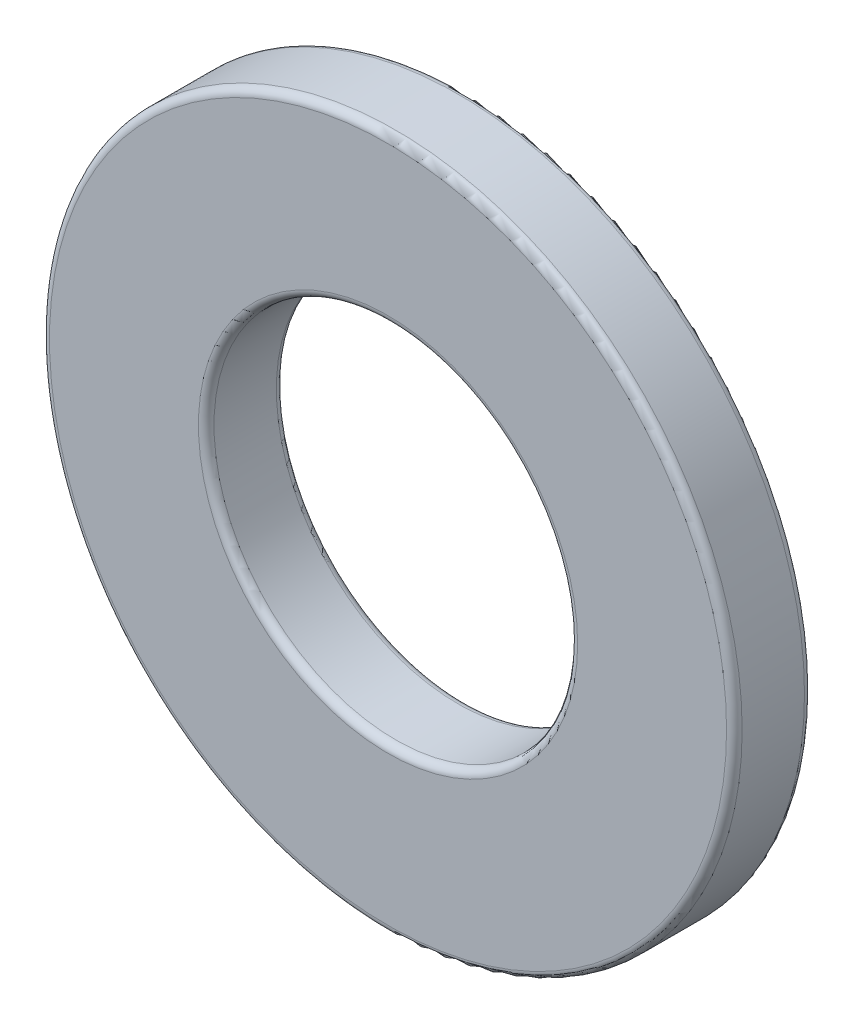
ISO-10303-21;
HEADER;
FILE_DESCRIPTION(('STEP AP214'),'2;1');
FILE_NAME('part.step','',(''),(''),'','','');
FILE_SCHEMA(('AUTOMOTIVE_DESIGN { 1 0 10303 214 1 1 1 1 }'));
ENDSEC;
DATA;
#1=APPLICATION_CONTEXT('core data for automotive mechanical design processes');
#2=APPLICATION_PROTOCOL_DEFINITION('international standard','automotive_design',2000,#1);
#3=PRODUCT_CONTEXT('',#1,'mechanical');
#4=PRODUCT('Part','Part','',(#3));
#5=PRODUCT_RELATED_PRODUCT_CATEGORY('part','',(#4));
#6=PRODUCT_DEFINITION_FORMATION('','',#4);
#7=PRODUCT_DEFINITION_CONTEXT('part definition',#1,'design');
#8=PRODUCT_DEFINITION('design','',#6,#7);
#9=PRODUCT_DEFINITION_SHAPE('','',#8);
#10=(LENGTH_UNIT() NAMED_UNIT(*) SI_UNIT(.MILLI.,.METRE.));
#11=(NAMED_UNIT(*) PLANE_ANGLE_UNIT() SI_UNIT($,.RADIAN.));
#12=(NAMED_UNIT(*) SI_UNIT($,.STERADIAN.) SOLID_ANGLE_UNIT());
#13=UNCERTAINTY_MEASURE_WITH_UNIT(LENGTH_MEASURE(1.E-05),#10,'distance_accuracy_value','');
#14=(GEOMETRIC_REPRESENTATION_CONTEXT(3) GLOBAL_UNCERTAINTY_ASSIGNED_CONTEXT((#13)) GLOBAL_UNIT_ASSIGNED_CONTEXT((#10,
#11,#12)) REPRESENTATION_CONTEXT('',''));
#15=CARTESIAN_POINT('',(0.,0.,0.));
#16=DIRECTION('',(0.,0.,1.));
#17=DIRECTION('',(1.,0.,0.));
#18=AXIS2_PLACEMENT_3D('',#15,#16,#17);
#19=CARTESIAN_POINT('',(0.,0.,-0.899999999999995));
#20=DIRECTION('',(0.,0.,1.));
#21=DIRECTION('',(1.,0.,0.));
#22=AXIS2_PLACEMENT_3D('',#19,#20,#21);
#23=CYLINDRICAL_SURFACE('',#22,8.);
#24=CARTESIAN_POINT('',(0.,0.,-0.719999999999995));
#25=DIRECTION('',(0.,0.,1.));
#26=DIRECTION('',(1.,0.,0.));
#27=AXIS2_PLACEMENT_3D('',#24,#25,#26);
#28=CIRCLE('',#27,8.);
#29=CARTESIAN_POINT('',(8.,0.,-0.719999999999995));
#30=VERTEX_POINT('',#29);
#31=EDGE_CURVE('E56',#30,#30,#28,.T.);
#32=ORIENTED_EDGE('',*,*,#31,.T.);
#33=EDGE_LOOP('',(#32));
#34=FACE_BOUND('',#33,.T.);
#35=CARTESIAN_POINT('',(0.,0.,0.720000000000006));
#36=DIRECTION('',(0.,0.,1.));
#37=DIRECTION('',(1.,0.,0.));
#38=AXIS2_PLACEMENT_3D('',#35,#36,#37);
#39=CIRCLE('',#38,8.);
#40=CARTESIAN_POINT('',(8.,0.,0.720000000000006));
#41=VERTEX_POINT('',#40);
#42=EDGE_CURVE('E59',#41,#41,#39,.F.);
#43=ORIENTED_EDGE('',*,*,#42,.T.);
#44=EDGE_LOOP('',(#43));
#45=FACE_BOUND('',#44,.T.);
#46=ADVANCED_FACE('F30',(#34,#45),#23,.T.);
#47=CARTESIAN_POINT('',(0.,0.,-0.899999999999995));
#48=DIRECTION('',(0.,0.,1.));
#49=DIRECTION('',(1.,0.,0.));
#50=AXIS2_PLACEMENT_3D('',#47,#48,#49);
#51=PLANE('',#50);
#52=CARTESIAN_POINT('',(0.,0.,-0.899999999999995));
#53=DIRECTION('',(0.,0.,1.));
#54=DIRECTION('',(1.,0.,0.));
#55=AXIS2_PLACEMENT_3D('',#52,#53,#54);
#56=CIRCLE('',#55,7.82);
#57=CARTESIAN_POINT('',(7.82,0.,-0.899999999999995));
#58=VERTEX_POINT('',#57);
#59=EDGE_CURVE('E50',#58,#58,#56,.F.);
#60=ORIENTED_EDGE('',*,*,#59,.T.);
#61=EDGE_LOOP('',(#60));
#62=FACE_BOUND('',#61,.T.);
#63=CARTESIAN_POINT('',(0.,0.,-0.899999999999995));
#64=DIRECTION('',(0.,0.,1.));
#65=DIRECTION('',(1.,0.,0.));
#66=AXIS2_PLACEMENT_3D('',#63,#64,#65);
#67=CIRCLE('',#66,4.38);
#68=CARTESIAN_POINT('',(4.38,0.,-0.899999999999995));
#69=VERTEX_POINT('',#68);
#70=EDGE_CURVE('E53',#69,#69,#67,.T.);
#71=ORIENTED_EDGE('',*,*,#70,.T.);
#72=EDGE_LOOP('',(#71));
#73=FACE_BOUND('',#72,.T.);
#74=ADVANCED_FACE('F73',(#62,#73),#51,.F.);
#75=CARTESIAN_POINT('',(0.,0.,-0.899999999999995));
#76=DIRECTION('',(0.,0.,1.));
#77=DIRECTION('',(1.,0.,0.));
#78=AXIS2_PLACEMENT_3D('',#75,#76,#77);
#79=CYLINDRICAL_SURFACE('',#78,4.2);
#80=CARTESIAN_POINT('',(0.,0.,-0.719999999999995));
#81=DIRECTION('',(0.,0.,1.));
#82=DIRECTION('',(1.,0.,0.));
#83=AXIS2_PLACEMENT_3D('',#80,#81,#82);
#84=CIRCLE('',#83,4.2);
#85=CARTESIAN_POINT('',(4.2,0.,-0.719999999999995));
#86=VERTEX_POINT('',#85);
#87=EDGE_CURVE('E41',#86,#86,#84,.F.);
#88=ORIENTED_EDGE('',*,*,#87,.T.);
#89=EDGE_LOOP('',(#88));
#90=FACE_BOUND('',#89,.T.);
#91=CARTESIAN_POINT('',(0.,0.,0.720000000000006));
#92=DIRECTION('',(0.,0.,1.));
#93=DIRECTION('',(1.,0.,0.));
#94=AXIS2_PLACEMENT_3D('',#91,#92,#93);
#95=CIRCLE('',#94,4.2);
#96=CARTESIAN_POINT('',(4.2,0.,0.720000000000006));
#97=VERTEX_POINT('',#96);
#98=EDGE_CURVE('E45',#97,#97,#95,.T.);
#99=ORIENTED_EDGE('',*,*,#98,.T.);
#100=EDGE_LOOP('',(#99));
#101=FACE_BOUND('',#100,.T.);
#102=ADVANCED_FACE('F79',(#90,#101),#79,.F.);
#103=CARTESIAN_POINT('',(0.,0.,0.900000000000006));
#104=DIRECTION('',(0.,0.,1.));
#105=DIRECTION('',(1.,0.,0.));
#106=AXIS2_PLACEMENT_3D('',#103,#104,#105);
#107=PLANE('',#106);
#108=CARTESIAN_POINT('',(0.,0.,0.900000000000006));
#109=DIRECTION('',(0.,0.,1.));
#110=DIRECTION('',(1.,0.,0.));
#111=AXIS2_PLACEMENT_3D('',#108,#109,#110);
#112=CIRCLE('',#111,4.38);
#113=CARTESIAN_POINT('',(4.38,0.,0.900000000000006));
#114=VERTEX_POINT('',#113);
#115=EDGE_CURVE('E10',#114,#114,#112,.F.);
#116=ORIENTED_EDGE('',*,*,#115,.T.);
#117=EDGE_LOOP('',(#116));
#118=FACE_BOUND('',#117,.T.);
#119=CARTESIAN_POINT('',(0.,0.,0.900000000000006));
#120=DIRECTION('',(0.,0.,1.));
#121=DIRECTION('',(1.,0.,0.));
#122=AXIS2_PLACEMENT_3D('',#119,#120,#121);
#123=CIRCLE('',#122,7.82);
#124=CARTESIAN_POINT('',(7.82,0.,0.900000000000006));
#125=VERTEX_POINT('',#124);
#126=EDGE_CURVE('E37',#125,#125,#123,.T.);
#127=ORIENTED_EDGE('',*,*,#126,.T.);
#128=EDGE_LOOP('',(#127));
#129=FACE_BOUND('',#128,.T.);
#130=ADVANCED_FACE('F87',(#118,#129),#107,.T.);
#131=CARTESIAN_POINT('',(0.,0.,-0.719999999999995));
#132=DIRECTION('',(0.,0.,1.));
#133=DIRECTION('',(1.,0.,0.));
#134=AXIS2_PLACEMENT_3D('',#131,#132,#133);
#135=TOROIDAL_SURFACE('',#134,7.82,0.18);
#136=ORIENTED_EDGE('',*,*,#59,.F.);
#137=EDGE_LOOP('',(#136));
#138=FACE_BOUND('',#137,.T.);
#139=ORIENTED_EDGE('',*,*,#31,.F.);
#140=EDGE_LOOP('',(#139));
#141=FACE_BOUND('',#140,.T.);
#142=ADVANCED_FACE('F84',(#138,#141),#135,.T.);
#143=CARTESIAN_POINT('',(0.,0.,-0.719999999999995));
#144=DIRECTION('',(0.,0.,1.));
#145=DIRECTION('',(1.,0.,0.));
#146=AXIS2_PLACEMENT_3D('',#143,#144,#145);
#147=TOROIDAL_SURFACE('',#146,4.38,0.18);
#148=ORIENTED_EDGE('',*,*,#87,.F.);
#149=EDGE_LOOP('',(#148));
#150=FACE_BOUND('',#149,.T.);
#151=ORIENTED_EDGE('',*,*,#70,.F.);
#152=EDGE_LOOP('',(#151));
#153=FACE_BOUND('',#152,.T.);
#154=ADVANCED_FACE('F70',(#150,#153),#147,.T.);
#155=CARTESIAN_POINT('',(0.,0.,0.720000000000006));
#156=DIRECTION('',(0.,0.,1.));
#157=DIRECTION('',(1.,0.,0.));
#158=AXIS2_PLACEMENT_3D('',#155,#156,#157);
#159=TOROIDAL_SURFACE('',#158,4.38,0.18);
#160=ORIENTED_EDGE('',*,*,#115,.F.);
#161=EDGE_LOOP('',(#160));
#162=FACE_BOUND('',#161,.T.);
#163=ORIENTED_EDGE('',*,*,#98,.F.);
#164=EDGE_LOOP('',(#163));
#165=FACE_BOUND('',#164,.T.);
#166=ADVANCED_FACE('F66',(#162,#165),#159,.T.);
#167=CARTESIAN_POINT('',(0.,0.,0.720000000000006));
#168=DIRECTION('',(0.,0.,1.));
#169=DIRECTION('',(1.,0.,0.));
#170=AXIS2_PLACEMENT_3D('',#167,#168,#169);
#171=TOROIDAL_SURFACE('',#170,7.82,0.18);
#172=ORIENTED_EDGE('',*,*,#42,.F.);
#173=EDGE_LOOP('',(#172));
#174=FACE_BOUND('',#173,.T.);
#175=ORIENTED_EDGE('',*,*,#126,.F.);
#176=EDGE_LOOP('',(#175));
#177=FACE_BOUND('',#176,.T.);
#178=ADVANCED_FACE('F32',(#174,#177),#171,.T.);
#179=CLOSED_SHELL('',(#46,#74,#102,#130,#142,#154,#166,#178));
#180=MANIFOLD_SOLID_BREP('B2',#179);
#181=ADVANCED_BREP_SHAPE_REPRESENTATION('',(#18,#180),#14);
#182=SHAPE_DEFINITION_REPRESENTATION(#9,#181);
ENDSEC;
END-ISO-10303-21;
